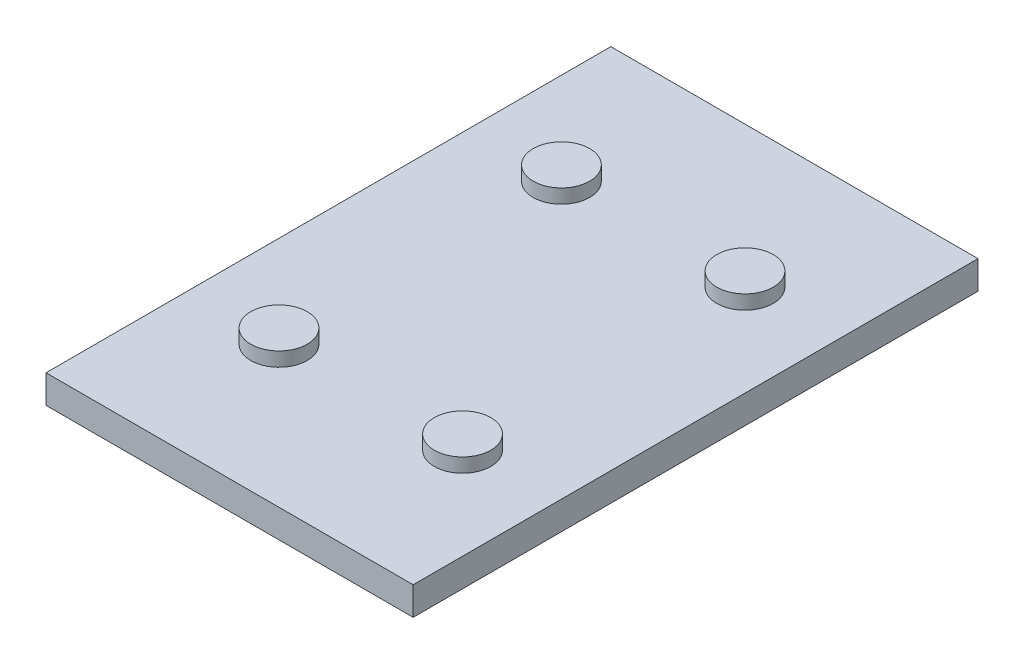
ISO-10303-21;
HEADER;
FILE_DESCRIPTION(('STEP AP214'),'2;1');
FILE_NAME('part.step','',(''),(''),'','','');
FILE_SCHEMA(('AUTOMOTIVE_DESIGN { 1 0 10303 214 1 1 1 1 }'));
ENDSEC;
DATA;
#1=APPLICATION_CONTEXT('core data for automotive mechanical design processes');
#2=APPLICATION_PROTOCOL_DEFINITION('international standard','automotive_design',2000,#1);
#3=PRODUCT_CONTEXT('',#1,'mechanical');
#4=PRODUCT('Part','Part','',(#3));
#5=PRODUCT_RELATED_PRODUCT_CATEGORY('part','',(#4));
#6=PRODUCT_DEFINITION_FORMATION('','',#4);
#7=PRODUCT_DEFINITION_CONTEXT('part definition',#1,'design');
#8=PRODUCT_DEFINITION('design','',#6,#7);
#9=PRODUCT_DEFINITION_SHAPE('','',#8);
#10=(LENGTH_UNIT() NAMED_UNIT(*) SI_UNIT(.MILLI.,.METRE.));
#11=(NAMED_UNIT(*) PLANE_ANGLE_UNIT() SI_UNIT($,.RADIAN.));
#12=(NAMED_UNIT(*) SI_UNIT($,.STERADIAN.) SOLID_ANGLE_UNIT());
#13=UNCERTAINTY_MEASURE_WITH_UNIT(LENGTH_MEASURE(1.E-05),#10,'distance_accuracy_value','');
#14=(GEOMETRIC_REPRESENTATION_CONTEXT(3) GLOBAL_UNCERTAINTY_ASSIGNED_CONTEXT((#13)) GLOBAL_UNIT_ASSIGNED_CONTEXT((#10,
#11,#12)) REPRESENTATION_CONTEXT('',''));
#15=CARTESIAN_POINT('',(0.,0.,0.));
#16=DIRECTION('',(0.,0.,1.));
#17=DIRECTION('',(1.,0.,0.));
#18=AXIS2_PLACEMENT_3D('',#15,#16,#17);
#19=CARTESIAN_POINT('',(-106.568983369222,25.4,-229.704347826087));
#20=DIRECTION('',(1.,0.,0.));
#21=DIRECTION('',(0.,0.,-1.));
#22=AXIS2_PLACEMENT_3D('',#19,#20,#21);
#23=PLANE('',#22);
#24=DIRECTION('',(0.,0.,1.));
#25=VECTOR('',#24,1.);
#26=CARTESIAN_POINT('',(-106.568983369222,0.,-229.704347826087));
#27=LINE('',#26,#25);
#28=CARTESIAN_POINT('',(-106.568983369222,0.,-229.704347826087));
#29=VERTEX_POINT('',#28);
#30=CARTESIAN_POINT('',(-106.568983369222,0.,278.295652173913));
#31=VERTEX_POINT('',#30);
#32=EDGE_CURVE('E106',#29,#31,#27,.T.);
#33=ORIENTED_EDGE('',*,*,#32,.T.);
#34=DIRECTION('',(0.,-1.,0.));
#35=VECTOR('',#34,1.);
#36=CARTESIAN_POINT('',(-106.568983369222,25.4,278.295652173913));
#37=LINE('',#36,#35);
#38=CARTESIAN_POINT('',(-106.568983369222,25.4,278.295652173913));
#39=VERTEX_POINT('',#38);
#40=EDGE_CURVE('E11',#39,#31,#37,.T.);
#41=ORIENTED_EDGE('',*,*,#40,.F.);
#42=DIRECTION('',(0.,0.,1.));
#43=VECTOR('',#42,1.);
#44=CARTESIAN_POINT('',(-106.568983369222,25.4,-229.704347826087));
#45=LINE('',#44,#43);
#46=CARTESIAN_POINT('',(-106.568983369222,25.4,-229.704347826087));
#47=VERTEX_POINT('',#46);
#48=EDGE_CURVE('E94',#47,#39,#45,.T.);
#49=ORIENTED_EDGE('',*,*,#48,.F.);
#50=DIRECTION('',(0.,-1.,0.));
#51=VECTOR('',#50,1.);
#52=CARTESIAN_POINT('',(-106.568983369222,25.4,-229.704347826087));
#53=LINE('',#52,#51);
#54=EDGE_CURVE('E102',#47,#29,#53,.T.);
#55=ORIENTED_EDGE('',*,*,#54,.T.);
#56=EDGE_LOOP('',(#33,#41,#49,#55));
#57=FACE_BOUND('',#56,.T.);
#58=ADVANCED_FACE('F43',(#57),#23,.F.);
#59=CARTESIAN_POINT('',(-106.568983369222,25.4,278.295652173913));
#60=DIRECTION('',(0.,0.,-1.));
#61=DIRECTION('',(-1.,0.,0.));
#62=AXIS2_PLACEMENT_3D('',#59,#60,#61);
#63=PLANE('',#62);
#64=DIRECTION('',(1.,0.,0.));
#65=VECTOR('',#64,1.);
#66=CARTESIAN_POINT('',(-106.568983369222,0.,278.295652173913));
#67=LINE('',#66,#65);
#68=CARTESIAN_POINT('',(223.631016630778,0.,278.295652173913));
#69=VERTEX_POINT('',#68);
#70=EDGE_CURVE('E98',#31,#69,#67,.T.);
#71=ORIENTED_EDGE('',*,*,#70,.T.);
#72=DIRECTION('',(0.,-1.,0.));
#73=VECTOR('',#72,1.);
#74=CARTESIAN_POINT('',(223.631016630778,25.4,278.295652173913));
#75=LINE('',#74,#73);
#76=CARTESIAN_POINT('',(223.631016630778,25.4,278.295652173913));
#77=VERTEX_POINT('',#76);
#78=EDGE_CURVE('E51',#77,#69,#75,.T.);
#79=ORIENTED_EDGE('',*,*,#78,.F.);
#80=DIRECTION('',(1.,0.,0.));
#81=VECTOR('',#80,1.);
#82=CARTESIAN_POINT('',(-106.568983369222,25.4,278.295652173913));
#83=LINE('',#82,#81);
#84=EDGE_CURVE('E89',#39,#77,#83,.T.);
#85=ORIENTED_EDGE('',*,*,#84,.F.);
#86=ORIENTED_EDGE('',*,*,#40,.T.);
#87=EDGE_LOOP('',(#71,#79,#85,#86));
#88=FACE_BOUND('',#87,.T.);
#89=ADVANCED_FACE('F97',(#88),#63,.F.);
#90=CARTESIAN_POINT('',(223.631016630778,25.4,-229.704347826087));
#91=DIRECTION('',(-1.,0.,0.));
#92=DIRECTION('',(0.,0.,1.));
#93=AXIS2_PLACEMENT_3D('',#90,#91,#92);
#94=PLANE('',#93);
#95=DIRECTION('',(0.,0.,-1.));
#96=VECTOR('',#95,1.);
#97=CARTESIAN_POINT('',(223.631016630778,0.,-229.704347826087));
#98=LINE('',#97,#96);
#99=CARTESIAN_POINT('',(223.631016630778,0.,-229.704347826087));
#100=VERTEX_POINT('',#99);
#101=EDGE_CURVE('E76',#69,#100,#98,.T.);
#102=ORIENTED_EDGE('',*,*,#101,.T.);
#103=DIRECTION('',(0.,-1.,0.));
#104=VECTOR('',#103,1.);
#105=CARTESIAN_POINT('',(223.631016630778,25.4,-229.704347826087));
#106=LINE('',#105,#104);
#107=CARTESIAN_POINT('',(223.631016630778,25.4,-229.704347826087));
#108=VERTEX_POINT('',#107);
#109=EDGE_CURVE('E99',#108,#100,#106,.T.);
#110=ORIENTED_EDGE('',*,*,#109,.F.);
#111=DIRECTION('',(0.,0.,-1.));
#112=VECTOR('',#111,1.);
#113=CARTESIAN_POINT('',(223.631016630778,25.4,-229.704347826087));
#114=LINE('',#113,#112);
#115=EDGE_CURVE('E92',#77,#108,#114,.T.);
#116=ORIENTED_EDGE('',*,*,#115,.F.);
#117=ORIENTED_EDGE('',*,*,#78,.T.);
#118=EDGE_LOOP('',(#102,#110,#116,#117));
#119=FACE_BOUND('',#118,.T.);
#120=ADVANCED_FACE('F100',(#119),#94,.F.);
#121=CARTESIAN_POINT('',(-106.568983369222,25.4,-229.704347826087));
#122=DIRECTION('',(0.,0.,1.));
#123=DIRECTION('',(1.,0.,0.));
#124=AXIS2_PLACEMENT_3D('',#121,#122,#123);
#125=PLANE('',#124);
#126=DIRECTION('',(-1.,0.,0.));
#127=VECTOR('',#126,1.);
#128=CARTESIAN_POINT('',(-106.568983369222,0.,-229.704347826087));
#129=LINE('',#128,#127);
#130=EDGE_CURVE('E82',#100,#29,#129,.T.);
#131=ORIENTED_EDGE('',*,*,#130,.T.);
#132=ORIENTED_EDGE('',*,*,#54,.F.);
#133=DIRECTION('',(-1.,0.,0.));
#134=VECTOR('',#133,1.);
#135=CARTESIAN_POINT('',(-106.568983369222,25.4,-229.704347826087));
#136=LINE('',#135,#134);
#137=EDGE_CURVE('E59',#108,#47,#136,.T.);
#138=ORIENTED_EDGE('',*,*,#137,.F.);
#139=ORIENTED_EDGE('',*,*,#109,.T.);
#140=EDGE_LOOP('',(#131,#132,#138,#139));
#141=FACE_BOUND('',#140,.T.);
#142=ADVANCED_FACE('F114',(#141),#125,.F.);
#143=CARTESIAN_POINT('',(0.,25.4,0.));
#144=DIRECTION('',(0.,1.,0.));
#145=DIRECTION('',(0.,0.,1.));
#146=AXIS2_PLACEMENT_3D('',#143,#144,#145);
#147=PLANE('',#146);
#148=CARTESIAN_POINT('',(-24.0189833692154,25.4,151.295652173913));
#149=DIRECTION('',(0.,1.,0.));
#150=DIRECTION('',(0.,0.,1.));
#151=AXIS2_PLACEMENT_3D('',#148,#149,#150);
#152=CIRCLE('',#151,25.4);
#153=CARTESIAN_POINT('',(-24.0189833692154,25.4,176.695652173913));
#154=VERTEX_POINT('',#153);
#155=EDGE_CURVE('E129',#154,#154,#152,.T.);
#156=ORIENTED_EDGE('',*,*,#155,.F.);
#157=EDGE_LOOP('',(#156));
#158=FACE_BOUND('',#157,.T.);
#159=CARTESIAN_POINT('',(141.081016630785,25.4,151.295652173913));
#160=DIRECTION('',(0.,1.,0.));
#161=DIRECTION('',(0.,0.,1.));
#162=AXIS2_PLACEMENT_3D('',#159,#160,#161);
#163=CIRCLE('',#162,25.4);
#164=CARTESIAN_POINT('',(141.081016630785,25.4,176.695652173913));
#165=VERTEX_POINT('',#164);
#166=EDGE_CURVE('E135',#165,#165,#163,.T.);
#167=ORIENTED_EDGE('',*,*,#166,.F.);
#168=EDGE_LOOP('',(#167));
#169=FACE_BOUND('',#168,.T.);
#170=CARTESIAN_POINT('',(141.081016630778,25.4,-102.704347826087));
#171=DIRECTION('',(0.,1.,0.));
#172=DIRECTION('',(0.,0.,1.));
#173=AXIS2_PLACEMENT_3D('',#170,#171,#172);
#174=CIRCLE('',#173,25.4);
#175=CARTESIAN_POINT('',(141.081016630778,25.4,-77.304347826087));
#176=VERTEX_POINT('',#175);
#177=EDGE_CURVE('E123',#176,#176,#174,.T.);
#178=ORIENTED_EDGE('',*,*,#177,.F.);
#179=EDGE_LOOP('',(#178));
#180=FACE_BOUND('',#179,.T.);
#181=CARTESIAN_POINT('',(-24.0189833692216,25.4,-102.704347826087));
#182=DIRECTION('',(0.,1.,0.));
#183=DIRECTION('',(0.,0.,1.));
#184=AXIS2_PLACEMENT_3D('',#181,#182,#183);
#185=CIRCLE('',#184,25.4);
#186=CARTESIAN_POINT('',(-24.0189833692216,25.4,-77.304347826087));
#187=VERTEX_POINT('',#186);
#188=EDGE_CURVE('E120',#187,#187,#185,.T.);
#189=ORIENTED_EDGE('',*,*,#188,.F.);
#190=EDGE_LOOP('',(#189));
#191=FACE_BOUND('',#190,.T.);
#192=ORIENTED_EDGE('',*,*,#48,.T.);
#193=ORIENTED_EDGE('',*,*,#84,.T.);
#194=ORIENTED_EDGE('',*,*,#115,.T.);
#195=ORIENTED_EDGE('',*,*,#137,.T.);
#196=EDGE_LOOP('',(#192,#193,#194,#195));
#197=FACE_BOUND('',#196,.T.);
#198=ADVANCED_FACE('F90',(#158,#169,#180,#191,#197),#147,.T.);
#199=CARTESIAN_POINT('',(0.,0.,0.));
#200=DIRECTION('',(0.,1.,0.));
#201=DIRECTION('',(0.,0.,1.));
#202=AXIS2_PLACEMENT_3D('',#199,#200,#201);
#203=PLANE('',#202);
#204=ORIENTED_EDGE('',*,*,#32,.F.);
#205=ORIENTED_EDGE('',*,*,#130,.F.);
#206=ORIENTED_EDGE('',*,*,#101,.F.);
#207=ORIENTED_EDGE('',*,*,#70,.F.);
#208=EDGE_LOOP('',(#204,#205,#206,#207));
#209=FACE_BOUND('',#208,.T.);
#210=ADVANCED_FACE('F117',(#209),#203,.F.);
#211=CARTESIAN_POINT('',(-24.0189833692216,38.1,-102.704347826087));
#212=DIRECTION('',(0.,-1.,0.));
#213=DIRECTION('',(0.,0.,-1.));
#214=AXIS2_PLACEMENT_3D('',#211,#212,#213);
#215=CYLINDRICAL_SURFACE('',#214,25.4);
#216=CARTESIAN_POINT('',(-24.0189833692216,38.1,-102.704347826087));
#217=DIRECTION('',(0.,1.,0.));
#218=DIRECTION('',(0.,0.,1.));
#219=AXIS2_PLACEMENT_3D('',#216,#217,#218);
#220=CIRCLE('',#219,25.4);
#221=CARTESIAN_POINT('',(-24.0189833692216,38.1,-77.304347826087));
#222=VERTEX_POINT('',#221);
#223=EDGE_CURVE('E109',#222,#222,#220,.T.);
#224=ORIENTED_EDGE('',*,*,#223,.F.);
#225=EDGE_LOOP('',(#224));
#226=FACE_BOUND('',#225,.T.);
#227=ORIENTED_EDGE('',*,*,#188,.T.);
#228=EDGE_LOOP('',(#227));
#229=FACE_BOUND('',#228,.T.);
#230=ADVANCED_FACE('F152',(#226,#229),#215,.T.);
#231=CARTESIAN_POINT('',(-24.0189833692216,38.1,-102.704347826087));
#232=DIRECTION('',(0.,1.,0.));
#233=DIRECTION('',(0.,0.,1.));
#234=AXIS2_PLACEMENT_3D('',#231,#232,#233);
#235=PLANE('',#234);
#236=ORIENTED_EDGE('',*,*,#223,.T.);
#237=EDGE_LOOP('',(#236));
#238=FACE_BOUND('',#237,.T.);
#239=ADVANCED_FACE('F154',(#238),#235,.T.);
#240=CARTESIAN_POINT('',(141.081016630778,38.1,-102.704347826087));
#241=DIRECTION('',(0.,-1.,0.));
#242=DIRECTION('',(0.,0.,-1.));
#243=AXIS2_PLACEMENT_3D('',#240,#241,#242);
#244=CYLINDRICAL_SURFACE('',#243,25.4);
#245=CARTESIAN_POINT('',(141.081016630778,38.1,-102.704347826087));
#246=DIRECTION('',(0.,1.,0.));
#247=DIRECTION('',(0.,0.,1.));
#248=AXIS2_PLACEMENT_3D('',#245,#246,#247);
#249=CIRCLE('',#248,25.4);
#250=CARTESIAN_POINT('',(141.081016630778,38.1,-77.304347826087));
#251=VERTEX_POINT('',#250);
#252=EDGE_CURVE('E138',#251,#251,#249,.T.);
#253=ORIENTED_EDGE('',*,*,#252,.F.);
#254=EDGE_LOOP('',(#253));
#255=FACE_BOUND('',#254,.T.);
#256=ORIENTED_EDGE('',*,*,#177,.T.);
#257=EDGE_LOOP('',(#256));
#258=FACE_BOUND('',#257,.T.);
#259=ADVANCED_FACE('F144',(#255,#258),#244,.T.);
#260=CARTESIAN_POINT('',(141.081016630778,38.1,-102.704347826087));
#261=DIRECTION('',(0.,1.,0.));
#262=DIRECTION('',(0.,0.,1.));
#263=AXIS2_PLACEMENT_3D('',#260,#261,#262);
#264=PLANE('',#263);
#265=ORIENTED_EDGE('',*,*,#252,.T.);
#266=EDGE_LOOP('',(#265));
#267=FACE_BOUND('',#266,.T.);
#268=ADVANCED_FACE('F245',(#267),#264,.T.);
#269=CARTESIAN_POINT('',(141.081016630785,38.1,151.295652173913));
#270=DIRECTION('',(0.,-1.,0.));
#271=DIRECTION('',(0.,0.,-1.));
#272=AXIS2_PLACEMENT_3D('',#269,#270,#271);
#273=CYLINDRICAL_SURFACE('',#272,25.4);
#274=CARTESIAN_POINT('',(141.081016630785,38.1,151.295652173913));
#275=DIRECTION('',(0.,1.,0.));
#276=DIRECTION('',(0.,0.,1.));
#277=AXIS2_PLACEMENT_3D('',#274,#275,#276);
#278=CIRCLE('',#277,25.4);
#279=CARTESIAN_POINT('',(141.081016630785,38.1,176.695652173913));
#280=VERTEX_POINT('',#279);
#281=EDGE_CURVE('E132',#280,#280,#278,.T.);
#282=ORIENTED_EDGE('',*,*,#281,.F.);
#283=EDGE_LOOP('',(#282));
#284=FACE_BOUND('',#283,.T.);
#285=ORIENTED_EDGE('',*,*,#166,.T.);
#286=EDGE_LOOP('',(#285));
#287=FACE_BOUND('',#286,.T.);
#288=ADVANCED_FACE('F254',(#284,#287),#273,.T.);
#289=CARTESIAN_POINT('',(141.081016630785,38.1,151.295652173913));
#290=DIRECTION('',(0.,1.,0.));
#291=DIRECTION('',(0.,0.,1.));
#292=AXIS2_PLACEMENT_3D('',#289,#290,#291);
#293=PLANE('',#292);
#294=ORIENTED_EDGE('',*,*,#281,.T.);
#295=EDGE_LOOP('',(#294));
#296=FACE_BOUND('',#295,.T.);
#297=ADVANCED_FACE('F263',(#296),#293,.T.);
#298=CARTESIAN_POINT('',(-24.0189833692154,38.1,151.295652173913));
#299=DIRECTION('',(0.,-1.,0.));
#300=DIRECTION('',(0.,0.,-1.));
#301=AXIS2_PLACEMENT_3D('',#298,#299,#300);
#302=CYLINDRICAL_SURFACE('',#301,25.4);
#303=CARTESIAN_POINT('',(-24.0189833692154,38.1,151.295652173913));
#304=DIRECTION('',(0.,1.,0.));
#305=DIRECTION('',(0.,0.,1.));
#306=AXIS2_PLACEMENT_3D('',#303,#304,#305);
#307=CIRCLE('',#306,25.4);
#308=CARTESIAN_POINT('',(-24.0189833692154,38.1,176.695652173913));
#309=VERTEX_POINT('',#308);
#310=EDGE_CURVE('E126',#309,#309,#307,.T.);
#311=ORIENTED_EDGE('',*,*,#310,.F.);
#312=EDGE_LOOP('',(#311));
#313=FACE_BOUND('',#312,.T.);
#314=ORIENTED_EDGE('',*,*,#155,.T.);
#315=EDGE_LOOP('',(#314));
#316=FACE_BOUND('',#315,.T.);
#317=ADVANCED_FACE('F272',(#313,#316),#302,.T.);
#318=CARTESIAN_POINT('',(-24.0189833692154,38.1,151.295652173913));
#319=DIRECTION('',(0.,1.,0.));
#320=DIRECTION('',(0.,0.,1.));
#321=AXIS2_PLACEMENT_3D('',#318,#319,#320);
#322=PLANE('',#321);
#323=ORIENTED_EDGE('',*,*,#310,.T.);
#324=EDGE_LOOP('',(#323));
#325=FACE_BOUND('',#324,.T.);
#326=ADVANCED_FACE('F281',(#325),#322,.T.);
#327=CLOSED_SHELL('',(#58,#89,#120,#142,#198,#210,#230,#239,#259,#268,#288,#297,#317,#326));
#328=MANIFOLD_SOLID_BREP('B2',#327);
#329=ADVANCED_BREP_SHAPE_REPRESENTATION('',(#18,#328),#14);
#330=SHAPE_DEFINITION_REPRESENTATION(#9,#329);
ENDSEC;
END-ISO-10303-21;
